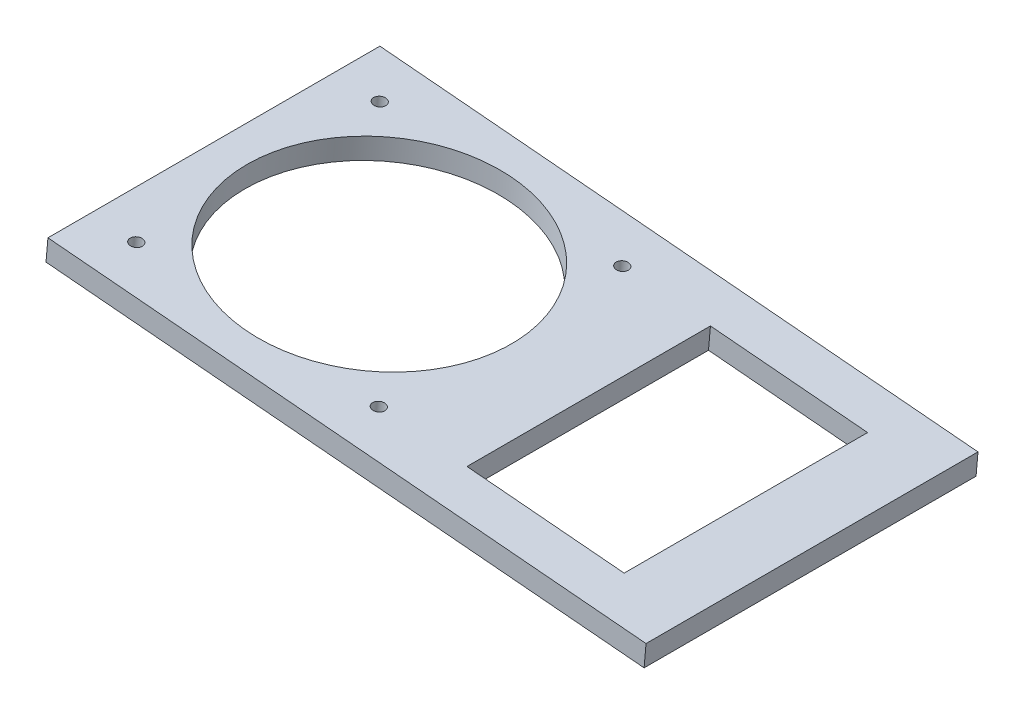
ISO-10303-21;
HEADER;
FILE_DESCRIPTION(('STEP AP214'),'2;1');
FILE_NAME('part.step','',(''),(''),'','','');
FILE_SCHEMA(('AUTOMOTIVE_DESIGN { 1 0 10303 214 1 1 1 1 }'));
ENDSEC;
DATA;
#1=APPLICATION_CONTEXT('core data for automotive mechanical design processes');
#2=APPLICATION_PROTOCOL_DEFINITION('international standard','automotive_design',2000,#1);
#3=PRODUCT_CONTEXT('',#1,'mechanical');
#4=PRODUCT('Part','Part','',(#3));
#5=PRODUCT_RELATED_PRODUCT_CATEGORY('part','',(#4));
#6=PRODUCT_DEFINITION_FORMATION('','',#4);
#7=PRODUCT_DEFINITION_CONTEXT('part definition',#1,'design');
#8=PRODUCT_DEFINITION('design','',#6,#7);
#9=PRODUCT_DEFINITION_SHAPE('','',#8);
#10=(LENGTH_UNIT() NAMED_UNIT(*) SI_UNIT(.MILLI.,.METRE.));
#11=(NAMED_UNIT(*) PLANE_ANGLE_UNIT() SI_UNIT($,.RADIAN.));
#12=(NAMED_UNIT(*) SI_UNIT($,.STERADIAN.) SOLID_ANGLE_UNIT());
#13=UNCERTAINTY_MEASURE_WITH_UNIT(LENGTH_MEASURE(1.E-05),#10,'distance_accuracy_value','');
#14=(GEOMETRIC_REPRESENTATION_CONTEXT(3) GLOBAL_UNCERTAINTY_ASSIGNED_CONTEXT((#13)) GLOBAL_UNIT_ASSIGNED_CONTEXT((#10,
#11,#12)) REPRESENTATION_CONTEXT('',''));
#15=CARTESIAN_POINT('',(0.,0.,0.));
#16=DIRECTION('',(0.,0.,1.));
#17=DIRECTION('',(1.,0.,0.));
#18=AXIS2_PLACEMENT_3D('',#15,#16,#17);
#19=CARTESIAN_POINT('',(-137.563755828843,331.297262379926,95.25));
#20=DIRECTION('',(-0.0871557427476588,-0.996194698091746,0.));
#21=DIRECTION('',(0.996194698091746,-0.0871557427476588,0.));
#22=AXIS2_PLACEMENT_3D('',#19,#20,#21);
#23=PLANE('',#22);
#24=DIRECTION('',(0.996194698091746,-0.0871557427476582,0.));
#25=VECTOR('',#24,1.);
#26=CARTESIAN_POINT('',(-30.0245381698388,321.888799950316,82.55));
#27=LINE('',#26,#25);
#28=CARTESIAN_POINT('',(-30.0245381698408,321.888799950316,82.55));
#29=VERTEX_POINT('',#28);
#30=CARTESIAN_POINT('',(15.0679589958335,317.943717638245,82.55));
#31=VERTEX_POINT('',#30);
#32=EDGE_CURVE('E109',#29,#31,#27,.T.);
#33=ORIENTED_EDGE('',*,*,#32,.F.);
#34=DIRECTION('',(0.,0.,1.));
#35=VECTOR('',#34,1.);
#36=CARTESIAN_POINT('',(-30.0245381698388,321.888799950316,12.7));
#37=LINE('',#36,#35);
#38=CARTESIAN_POINT('',(-30.0245381698388,321.888799950316,12.7));
#39=VERTEX_POINT('',#38);
#40=EDGE_CURVE('E47',#39,#29,#37,.T.);
#41=ORIENTED_EDGE('',*,*,#40,.F.);
#42=DIRECTION('',(-0.996194698091746,0.0871557427476582,0.));
#43=VECTOR('',#42,1.);
#44=CARTESIAN_POINT('',(-30.0245381698388,321.888799950316,12.7));
#45=LINE('',#44,#43);
#46=CARTESIAN_POINT('',(15.0679589958335,317.943717638245,12.7));
#47=VERTEX_POINT('',#46);
#48=EDGE_CURVE('E115',#47,#39,#45,.T.);
#49=ORIENTED_EDGE('',*,*,#48,.F.);
#50=DIRECTION('',(0.,0.,-1.));
#51=VECTOR('',#50,1.);
#52=CARTESIAN_POINT('',(15.0679589958335,317.943717638245,12.7));
#53=LINE('',#52,#51);
#54=EDGE_CURVE('E100',#31,#47,#53,.T.);
#55=ORIENTED_EDGE('',*,*,#54,.F.);
#56=EDGE_LOOP('',(#33,#41,#49,#55));
#57=FACE_BOUND('',#56,.T.);
#58=CARTESIAN_POINT('',(-55.3278835013691,324.102555816107,12.7));
#59=DIRECTION('',(0.0871557427476617,0.996194698091745,0.));
#60=DIRECTION('',(-0.996194698091745,0.0871557427476617,0.));
#61=AXIS2_PLACEMENT_3D('',#58,#59,#60);
#62=CIRCLE('',#61,1.74999999999909);
#63=CARTESIAN_POINT('',(-57.0712242230288,324.255078365915,12.7));
#64=VERTEX_POINT('',#63);
#65=EDGE_CURVE('E122',#64,#64,#62,.T.);
#66=ORIENTED_EDGE('',*,*,#65,.F.);
#67=EDGE_LOOP('',(#66));
#68=FACE_BOUND('',#67,.T.);
#69=CARTESIAN_POINT('',(-55.3278835013691,324.102555816107,82.55));
#70=DIRECTION('',(0.0871557427476617,0.996194698091745,0.));
#71=DIRECTION('',(-0.996194698091745,0.0871557427476617,0.));
#72=AXIS2_PLACEMENT_3D('',#69,#70,#71);
#73=CIRCLE('',#72,1.74999999999909);
#74=CARTESIAN_POINT('',(-57.0712242230288,324.255078365915,82.55));
#75=VERTEX_POINT('',#74);
#76=EDGE_CURVE('E128',#75,#75,#73,.T.);
#77=ORIENTED_EDGE('',*,*,#76,.F.);
#78=EDGE_LOOP('',(#77));
#79=FACE_BOUND('',#78,.T.);
#80=CARTESIAN_POINT('',(-124.912083163078,330.190384447031,82.55));
#81=DIRECTION('',(0.0871557427476617,0.996194698091745,0.));
#82=DIRECTION('',(-0.996194698091745,0.0871557427476617,0.));
#83=AXIS2_PLACEMENT_3D('',#80,#81,#82);
#84=CIRCLE('',#83,1.74999999999911);
#85=CARTESIAN_POINT('',(-126.655423884737,330.342906996839,82.55));
#86=VERTEX_POINT('',#85);
#87=EDGE_CURVE('E132',#86,#86,#84,.T.);
#88=ORIENTED_EDGE('',*,*,#87,.F.);
#89=EDGE_LOOP('',(#88));
#90=FACE_BOUND('',#89,.T.);
#91=CARTESIAN_POINT('',(-124.912083163078,330.190384447031,12.7));
#92=DIRECTION('',(0.0871557427476617,0.996194698091745,0.));
#93=DIRECTION('',(-0.996194698091745,0.0871557427476617,0.));
#94=AXIS2_PLACEMENT_3D('',#91,#92,#93);
#95=CIRCLE('',#94,1.74999999999911);
#96=CARTESIAN_POINT('',(-126.655423884737,330.342906996839,12.7));
#97=VERTEX_POINT('',#96);
#98=EDGE_CURVE('E136',#97,#97,#95,.T.);
#99=ORIENTED_EDGE('',*,*,#98,.F.);
#100=EDGE_LOOP('',(#99));
#101=FACE_BOUND('',#100,.T.);
#102=CARTESIAN_POINT('',(-90.1199833322233,327.146470131569,47.625));
#103=DIRECTION('',(0.0871557427476617,0.996194698091745,0.));
#104=DIRECTION('',(-0.996194698091745,0.0871557427476617,0.));
#105=AXIS2_PLACEMENT_3D('',#102,#103,#104);
#106=CIRCLE('',#105,38.0999999999991);
#107=CARTESIAN_POINT('',(-128.075001329518,330.467103930255,47.625));
#108=VERTEX_POINT('',#107);
#109=EDGE_CURVE('E140',#108,#108,#106,.T.);
#110=ORIENTED_EDGE('',*,*,#109,.F.);
#111=EDGE_LOOP('',(#110));
#112=FACE_BOUND('',#111,.T.);
#113=DIRECTION('',(-0.996194698091745,0.0871557427476588,0.));
#114=VECTOR('',#113,1.);
#115=CARTESIAN_POINT('',(-137.563755828843,331.297262379926,0.));
#116=LINE('',#115,#114);
#117=CARTESIAN_POINT('',(34.0454679944822,316.283400738902,0.));
#118=VERTEX_POINT('',#117);
#119=CARTESIAN_POINT('',(-137.563755828843,331.297262379926,0.));
#120=VERTEX_POINT('',#119);
#121=EDGE_CURVE('E155',#118,#120,#116,.T.);
#122=ORIENTED_EDGE('',*,*,#121,.T.);
#123=DIRECTION('',(0.,0.,-1.));
#124=VECTOR('',#123,1.);
#125=CARTESIAN_POINT('',(-137.563755828843,331.297262379926,95.25));
#126=LINE('',#125,#124);
#127=CARTESIAN_POINT('',(-137.563755828843,331.297262379926,95.25));
#128=VERTEX_POINT('',#127);
#129=EDGE_CURVE('E171',#128,#120,#126,.T.);
#130=ORIENTED_EDGE('',*,*,#129,.F.);
#131=DIRECTION('',(-0.996194698091745,0.0871557427476588,0.));
#132=VECTOR('',#131,1.);
#133=CARTESIAN_POINT('',(-137.563755828843,331.297262379926,95.25));
#134=LINE('',#133,#132);
#135=CARTESIAN_POINT('',(34.0454679944822,316.283400738902,95.25));
#136=VERTEX_POINT('',#135);
#137=EDGE_CURVE('E144',#136,#128,#134,.T.);
#138=ORIENTED_EDGE('',*,*,#137,.F.);
#139=DIRECTION('',(0.,0.,-1.));
#140=VECTOR('',#139,1.);
#141=CARTESIAN_POINT('',(34.0454679944822,316.283400738902,95.25));
#142=LINE('',#141,#140);
#143=EDGE_CURVE('E154',#136,#118,#142,.T.);
#144=ORIENTED_EDGE('',*,*,#143,.T.);
#145=EDGE_LOOP('',(#122,#130,#138,#144));
#146=FACE_BOUND('',#145,.T.);
#147=ADVANCED_FACE('F33',(#57,#68,#79,#90,#101,#112,#146),#23,.F.);
#148=CARTESIAN_POINT('',(-137.563755828843,331.297262379926,95.25));
#149=DIRECTION('',(0.996194698091746,-0.0871557427476588,0.));
#150=DIRECTION('',(0.0871557427476588,0.996194698091746,0.));
#151=AXIS2_PLACEMENT_3D('',#148,#149,#150);
#152=PLANE('',#151);
#153=DIRECTION('',(-0.0871557427476588,-0.996194698091745,0.));
#154=VECTOR('',#153,1.);
#155=CARTESIAN_POINT('',(-137.563755828843,331.297262379926,0.));
#156=LINE('',#155,#154);
#157=CARTESIAN_POINT('',(-138.11719479529,324.971426047043,0.));
#158=VERTEX_POINT('',#157);
#159=EDGE_CURVE('E158',#120,#158,#156,.T.);
#160=ORIENTED_EDGE('',*,*,#159,.T.);
#161=DIRECTION('',(0.,0.,-1.));
#162=VECTOR('',#161,1.);
#163=CARTESIAN_POINT('',(-138.11719479529,324.971426047043,95.25));
#164=LINE('',#163,#162);
#165=CARTESIAN_POINT('',(-138.11719479529,324.971426047043,95.25));
#166=VERTEX_POINT('',#165);
#167=EDGE_CURVE('E168',#166,#158,#164,.T.);
#168=ORIENTED_EDGE('',*,*,#167,.F.);
#169=DIRECTION('',(-0.0871557427476588,-0.996194698091745,0.));
#170=VECTOR('',#169,1.);
#171=CARTESIAN_POINT('',(-137.563755828843,331.297262379926,95.25));
#172=LINE('',#171,#170);
#173=EDGE_CURVE('E147',#128,#166,#172,.T.);
#174=ORIENTED_EDGE('',*,*,#173,.F.);
#175=ORIENTED_EDGE('',*,*,#129,.T.);
#176=EDGE_LOOP('',(#160,#168,#174,#175));
#177=FACE_BOUND('',#176,.T.);
#178=ADVANCED_FACE('F207',(#177),#152,.F.);
#179=CARTESIAN_POINT('',(-138.11719479529,324.971426047043,95.25));
#180=DIRECTION('',(0.0871557427476585,0.996194698091746,0.));
#181=DIRECTION('',(-0.996194698091746,0.0871557427476585,0.));
#182=AXIS2_PLACEMENT_3D('',#179,#180,#181);
#183=PLANE('',#182);
#184=DIRECTION('',(-0.996194698091746,0.0871557427476585,0.));
#185=VECTOR('',#184,1.);
#186=CARTESIAN_POINT('',(-138.11719479529,324.971426047043,12.7));
#187=LINE('',#186,#185);
#188=CARTESIAN_POINT('',(14.5145200293859,311.617881305362,12.7));
#189=VERTEX_POINT('',#188);
#190=CARTESIAN_POINT('',(-30.5779771362865,315.562963617433,12.7));
#191=VERTEX_POINT('',#190);
#192=EDGE_CURVE('E40',#189,#191,#187,.T.);
#193=ORIENTED_EDGE('',*,*,#192,.T.);
#194=DIRECTION('',(0.,0.,1.));
#195=VECTOR('',#194,1.);
#196=CARTESIAN_POINT('',(-30.5779771362865,315.562963617433,95.25));
#197=LINE('',#196,#195);
#198=CARTESIAN_POINT('',(-30.5779771362865,315.562963617433,82.55));
#199=VERTEX_POINT('',#198);
#200=EDGE_CURVE('E11',#191,#199,#197,.T.);
#201=ORIENTED_EDGE('',*,*,#200,.T.);
#202=DIRECTION('',(0.996194698091746,-0.0871557427476585,0.));
#203=VECTOR('',#202,1.);
#204=CARTESIAN_POINT('',(-138.11719479529,324.971426047043,82.55));
#205=LINE('',#204,#203);
#206=CARTESIAN_POINT('',(14.5145200293859,311.617881305362,82.55));
#207=VERTEX_POINT('',#206);
#208=EDGE_CURVE('E174',#199,#207,#205,.T.);
#209=ORIENTED_EDGE('',*,*,#208,.T.);
#210=DIRECTION('',(0.,0.,-1.));
#211=VECTOR('',#210,1.);
#212=CARTESIAN_POINT('',(14.5145200293859,311.617881305362,95.25));
#213=LINE('',#212,#211);
#214=EDGE_CURVE('E103',#207,#189,#213,.T.);
#215=ORIENTED_EDGE('',*,*,#214,.T.);
#216=EDGE_LOOP('',(#193,#201,#209,#215));
#217=FACE_BOUND('',#216,.T.);
#218=CARTESIAN_POINT('',(-55.8813224678168,317.776719483224,12.7));
#219=DIRECTION('',(0.0871557427476585,0.996194698091746,0.));
#220=DIRECTION('',(-0.996194698091746,0.0871557427476585,0.));
#221=AXIS2_PLACEMENT_3D('',#218,#219,#220);
#222=CIRCLE('',#221,1.74999999999909);
#223=CARTESIAN_POINT('',(-57.6246631894765,317.929242033032,12.7));
#224=VERTEX_POINT('',#223);
#225=EDGE_CURVE('E127',#224,#224,#222,.T.);
#226=ORIENTED_EDGE('',*,*,#225,.T.);
#227=EDGE_LOOP('',(#226));
#228=FACE_BOUND('',#227,.T.);
#229=CARTESIAN_POINT('',(-55.8813224678168,317.776719483224,82.55));
#230=DIRECTION('',(0.0871557427476585,0.996194698091746,0.));
#231=DIRECTION('',(-0.996194698091746,0.0871557427476585,0.));
#232=AXIS2_PLACEMENT_3D('',#229,#230,#231);
#233=CIRCLE('',#232,1.74999999999909);
#234=CARTESIAN_POINT('',(-57.6246631894765,317.929242033032,82.55));
#235=VERTEX_POINT('',#234);
#236=EDGE_CURVE('E131',#235,#235,#233,.T.);
#237=ORIENTED_EDGE('',*,*,#236,.T.);
#238=EDGE_LOOP('',(#237));
#239=FACE_BOUND('',#238,.T.);
#240=CARTESIAN_POINT('',(-125.465522129525,323.864548114148,82.55));
#241=DIRECTION('',(0.0871557427476585,0.996194698091746,0.));
#242=DIRECTION('',(-0.996194698091746,0.0871557427476585,0.));
#243=AXIS2_PLACEMENT_3D('',#240,#241,#242);
#244=CIRCLE('',#243,1.74999999999911);
#245=CARTESIAN_POINT('',(-127.208862851185,324.017070663956,82.55));
#246=VERTEX_POINT('',#245);
#247=EDGE_CURVE('E135',#246,#246,#244,.T.);
#248=ORIENTED_EDGE('',*,*,#247,.T.);
#249=EDGE_LOOP('',(#248));
#250=FACE_BOUND('',#249,.T.);
#251=CARTESIAN_POINT('',(-125.465522129525,323.864548114148,12.7));
#252=DIRECTION('',(0.0871557427476585,0.996194698091746,0.));
#253=DIRECTION('',(-0.996194698091746,0.0871557427476585,0.));
#254=AXIS2_PLACEMENT_3D('',#251,#252,#253);
#255=CIRCLE('',#254,1.74999999999911);
#256=CARTESIAN_POINT('',(-127.208862851185,324.017070663956,12.7));
#257=VERTEX_POINT('',#256);
#258=EDGE_CURVE('E139',#257,#257,#255,.T.);
#259=ORIENTED_EDGE('',*,*,#258,.T.);
#260=EDGE_LOOP('',(#259));
#261=FACE_BOUND('',#260,.T.);
#262=CARTESIAN_POINT('',(-90.673422298671,320.820633798686,47.625));
#263=DIRECTION('',(0.0871557427476585,0.996194698091746,0.));
#264=DIRECTION('',(-0.996194698091746,0.0871557427476585,0.));
#265=AXIS2_PLACEMENT_3D('',#262,#263,#264);
#266=CIRCLE('',#265,38.0999999999991);
#267=CARTESIAN_POINT('',(-128.628440295966,324.141267597372,47.625));
#268=VERTEX_POINT('',#267);
#269=EDGE_CURVE('E143',#268,#268,#266,.T.);
#270=ORIENTED_EDGE('',*,*,#269,.T.);
#271=EDGE_LOOP('',(#270));
#272=FACE_BOUND('',#271,.T.);
#273=DIRECTION('',(0.996194698091745,-0.0871557427476585,0.));
#274=VECTOR('',#273,1.);
#275=CARTESIAN_POINT('',(-138.11719479529,324.971426047043,0.));
#276=LINE('',#275,#274);
#277=CARTESIAN_POINT('',(33.4920290280346,309.957564406019,0.));
#278=VERTEX_POINT('',#277);
#279=EDGE_CURVE('E160',#158,#278,#276,.T.);
#280=ORIENTED_EDGE('',*,*,#279,.T.);
#281=DIRECTION('',(0.,0.,-1.));
#282=VECTOR('',#281,1.);
#283=CARTESIAN_POINT('',(33.4920290280346,309.957564406019,95.25));
#284=LINE('',#283,#282);
#285=CARTESIAN_POINT('',(33.4920290280346,309.957564406019,95.25));
#286=VERTEX_POINT('',#285);
#287=EDGE_CURVE('E165',#286,#278,#284,.T.);
#288=ORIENTED_EDGE('',*,*,#287,.F.);
#289=DIRECTION('',(0.996194698091745,-0.0871557427476585,0.));
#290=VECTOR('',#289,1.);
#291=CARTESIAN_POINT('',(-138.11719479529,324.971426047043,95.25));
#292=LINE('',#291,#290);
#293=EDGE_CURVE('E150',#166,#286,#292,.T.);
#294=ORIENTED_EDGE('',*,*,#293,.F.);
#295=ORIENTED_EDGE('',*,*,#167,.T.);
#296=EDGE_LOOP('',(#280,#288,#294,#295));
#297=FACE_BOUND('',#296,.T.);
#298=ADVANCED_FACE('F188',(#217,#228,#239,#250,#261,#272,#297),#183,.F.);
#299=CARTESIAN_POINT('',(34.0454679944822,316.283400738902,95.25));
#300=DIRECTION('',(-0.996194698091745,0.0871557427476606,0.));
#301=DIRECTION('',(-0.0871557427476606,-0.996194698091745,0.));
#302=AXIS2_PLACEMENT_3D('',#299,#300,#301);
#303=PLANE('',#302);
#304=DIRECTION('',(0.0871557427476607,0.996194698091745,0.));
#305=VECTOR('',#304,1.);
#306=CARTESIAN_POINT('',(34.0454679944822,316.283400738902,0.));
#307=LINE('',#306,#305);
#308=EDGE_CURVE('E148',#278,#118,#307,.T.);
#309=ORIENTED_EDGE('',*,*,#308,.T.);
#310=ORIENTED_EDGE('',*,*,#143,.F.);
#311=DIRECTION('',(0.0871557427476607,0.996194698091745,0.));
#312=VECTOR('',#311,1.);
#313=CARTESIAN_POINT('',(34.0454679944822,316.283400738902,95.25));
#314=LINE('',#313,#312);
#315=EDGE_CURVE('E152',#286,#136,#314,.T.);
#316=ORIENTED_EDGE('',*,*,#315,.F.);
#317=ORIENTED_EDGE('',*,*,#287,.T.);
#318=EDGE_LOOP('',(#309,#310,#316,#317));
#319=FACE_BOUND('',#318,.T.);
#320=ADVANCED_FACE('F215',(#319),#303,.F.);
#321=CARTESIAN_POINT('',(0.,0.,95.25));
#322=DIRECTION('',(0.,0.,-1.));
#323=DIRECTION('',(-1.,0.,0.));
#324=AXIS2_PLACEMENT_3D('',#321,#322,#323);
#325=PLANE('',#324);
#326=ORIENTED_EDGE('',*,*,#137,.T.);
#327=ORIENTED_EDGE('',*,*,#173,.T.);
#328=ORIENTED_EDGE('',*,*,#293,.T.);
#329=ORIENTED_EDGE('',*,*,#315,.T.);
#330=EDGE_LOOP('',(#326,#327,#328,#329));
#331=FACE_BOUND('',#330,.T.);
#332=ADVANCED_FACE('F220',(#331),#325,.F.);
#333=CARTESIAN_POINT('',(0.,0.,0.));
#334=DIRECTION('',(0.,0.,-1.));
#335=DIRECTION('',(-1.,0.,0.));
#336=AXIS2_PLACEMENT_3D('',#333,#334,#335);
#337=PLANE('',#336);
#338=ORIENTED_EDGE('',*,*,#121,.F.);
#339=ORIENTED_EDGE('',*,*,#308,.F.);
#340=ORIENTED_EDGE('',*,*,#279,.F.);
#341=ORIENTED_EDGE('',*,*,#159,.F.);
#342=EDGE_LOOP('',(#338,#339,#340,#341));
#343=FACE_BOUND('',#342,.T.);
#344=ADVANCED_FACE('F222',(#343),#337,.T.);
#345=CARTESIAN_POINT('',(-91.9769871555247,305.920819304807,47.625));
#346=DIRECTION('',(0.0871557427476617,0.996194698091745,0.));
#347=DIRECTION('',(-0.996194698091745,0.0871557427476617,0.));
#348=AXIS2_PLACEMENT_3D('',#345,#346,#347);
#349=CYLINDRICAL_SURFACE('',#348,38.0999999999991);
#350=ORIENTED_EDGE('',*,*,#109,.T.);
#351=EDGE_LOOP('',(#350));
#352=FACE_BOUND('',#351,.T.);
#353=ORIENTED_EDGE('',*,*,#269,.F.);
#354=EDGE_LOOP('',(#353));
#355=FACE_BOUND('',#354,.T.);
#356=ADVANCED_FACE('F225',(#352,#355),#349,.F.);
#357=CARTESIAN_POINT('',(-126.769086986379,308.964733620269,12.7));
#358=DIRECTION('',(0.0871557427476617,0.996194698091745,0.));
#359=DIRECTION('',(-0.996194698091745,0.0871557427476617,0.));
#360=AXIS2_PLACEMENT_3D('',#357,#358,#359);
#361=CYLINDRICAL_SURFACE('',#360,1.74999999999911);
#362=ORIENTED_EDGE('',*,*,#98,.T.);
#363=EDGE_LOOP('',(#362));
#364=FACE_BOUND('',#363,.T.);
#365=ORIENTED_EDGE('',*,*,#258,.F.);
#366=EDGE_LOOP('',(#365));
#367=FACE_BOUND('',#366,.T.);
#368=ADVANCED_FACE('F232',(#364,#367),#361,.F.);
#369=CARTESIAN_POINT('',(-126.769086986379,308.964733620269,82.55));
#370=DIRECTION('',(0.0871557427476617,0.996194698091745,0.));
#371=DIRECTION('',(-0.996194698091745,0.0871557427476617,0.));
#372=AXIS2_PLACEMENT_3D('',#369,#370,#371);
#373=CYLINDRICAL_SURFACE('',#372,1.74999999999911);
#374=ORIENTED_EDGE('',*,*,#87,.T.);
#375=EDGE_LOOP('',(#374));
#376=FACE_BOUND('',#375,.T.);
#377=ORIENTED_EDGE('',*,*,#247,.F.);
#378=EDGE_LOOP('',(#377));
#379=FACE_BOUND('',#378,.T.);
#380=ADVANCED_FACE('F236',(#376,#379),#373,.F.);
#381=CARTESIAN_POINT('',(-57.1848873246705,302.876904989345,82.55));
#382=DIRECTION('',(0.0871557427476617,0.996194698091745,0.));
#383=DIRECTION('',(-0.996194698091745,0.0871557427476617,0.));
#384=AXIS2_PLACEMENT_3D('',#381,#382,#383);
#385=CYLINDRICAL_SURFACE('',#384,1.74999999999909);
#386=ORIENTED_EDGE('',*,*,#76,.T.);
#387=EDGE_LOOP('',(#386));
#388=FACE_BOUND('',#387,.T.);
#389=ORIENTED_EDGE('',*,*,#236,.F.);
#390=EDGE_LOOP('',(#389));
#391=FACE_BOUND('',#390,.T.);
#392=ADVANCED_FACE('F202',(#388,#391),#385,.F.);
#393=CARTESIAN_POINT('',(-57.1848873246705,302.876904989345,12.7));
#394=DIRECTION('',(0.0871557427476617,0.996194698091745,0.));
#395=DIRECTION('',(-0.996194698091745,0.0871557427476617,0.));
#396=AXIS2_PLACEMENT_3D('',#393,#394,#395);
#397=CYLINDRICAL_SURFACE('',#396,1.74999999999909);
#398=ORIENTED_EDGE('',*,*,#65,.T.);
#399=EDGE_LOOP('',(#398));
#400=FACE_BOUND('',#399,.T.);
#401=ORIENTED_EDGE('',*,*,#225,.F.);
#402=EDGE_LOOP('',(#401));
#403=FACE_BOUND('',#402,.T.);
#404=ADVANCED_FACE('F195',(#400,#403),#397,.F.);
#405=CARTESIAN_POINT('',(-31.8815419931401,300.663149123555,12.7));
#406=DIRECTION('',(-0.996194698091746,0.0871557427476588,0.));
#407=DIRECTION('',(-0.0871557427476588,-0.996194698091746,0.));
#408=AXIS2_PLACEMENT_3D('',#405,#406,#407);
#409=PLANE('',#408);
#410=DIRECTION('',(0.0871557427476588,0.996194698091746,0.));
#411=VECTOR('',#410,1.);
#412=CARTESIAN_POINT('',(-31.8815419931401,300.663149123555,12.7));
#413=LINE('',#412,#411);
#414=EDGE_CURVE('E120',#191,#39,#413,.T.);
#415=ORIENTED_EDGE('',*,*,#414,.T.);
#416=ORIENTED_EDGE('',*,*,#40,.T.);
#417=DIRECTION('',(0.0871557427476588,0.996194698091746,0.));
#418=VECTOR('',#417,1.);
#419=CARTESIAN_POINT('',(-31.8815419931401,300.663149123555,82.55));
#420=LINE('',#419,#418);
#421=EDGE_CURVE('E106',#199,#29,#420,.T.);
#422=ORIENTED_EDGE('',*,*,#421,.F.);
#423=ORIENTED_EDGE('',*,*,#200,.F.);
#424=EDGE_LOOP('',(#415,#416,#422,#423));
#425=FACE_BOUND('',#424,.T.);
#426=ADVANCED_FACE('F193',(#425),#409,.F.);
#427=CARTESIAN_POINT('',(-31.8815419931401,300.663149123555,12.7));
#428=DIRECTION('',(0.,0.,-1.));
#429=DIRECTION('',(-1.,0.,0.));
#430=AXIS2_PLACEMENT_3D('',#427,#428,#429);
#431=PLANE('',#430);
#432=DIRECTION('',(0.0871557427476588,0.996194698091746,0.));
#433=VECTOR('',#432,1.);
#434=CARTESIAN_POINT('',(13.2109551725322,296.718066811484,12.7));
#435=LINE('',#434,#433);
#436=EDGE_CURVE('E105',#189,#47,#435,.T.);
#437=ORIENTED_EDGE('',*,*,#436,.T.);
#438=ORIENTED_EDGE('',*,*,#48,.T.);
#439=ORIENTED_EDGE('',*,*,#414,.F.);
#440=ORIENTED_EDGE('',*,*,#192,.F.);
#441=EDGE_LOOP('',(#437,#438,#439,#440));
#442=FACE_BOUND('',#441,.T.);
#443=ADVANCED_FACE('F192',(#442),#431,.F.);
#444=CARTESIAN_POINT('',(13.2109551725322,296.718066811484,12.7));
#445=DIRECTION('',(0.996194698091746,-0.0871557427476588,0.));
#446=DIRECTION('',(0.0871557427476588,0.996194698091746,0.));
#447=AXIS2_PLACEMENT_3D('',#444,#445,#446);
#448=PLANE('',#447);
#449=DIRECTION('',(0.0871557427476588,0.996194698091746,0.));
#450=VECTOR('',#449,1.);
#451=CARTESIAN_POINT('',(13.2109551725322,296.718066811484,82.55));
#452=LINE('',#451,#450);
#453=EDGE_CURVE('E55',#207,#31,#452,.T.);
#454=ORIENTED_EDGE('',*,*,#453,.T.);
#455=ORIENTED_EDGE('',*,*,#54,.T.);
#456=ORIENTED_EDGE('',*,*,#436,.F.);
#457=ORIENTED_EDGE('',*,*,#214,.F.);
#458=EDGE_LOOP('',(#454,#455,#456,#457));
#459=FACE_BOUND('',#458,.T.);
#460=ADVANCED_FACE('F97',(#459),#448,.F.);
#461=CARTESIAN_POINT('',(-31.8815419931401,300.663149123555,82.55));
#462=DIRECTION('',(0.,0.,1.));
#463=DIRECTION('',(1.,0.,0.));
#464=AXIS2_PLACEMENT_3D('',#461,#462,#463);
#465=PLANE('',#464);
#466=ORIENTED_EDGE('',*,*,#421,.T.);
#467=ORIENTED_EDGE('',*,*,#32,.T.);
#468=ORIENTED_EDGE('',*,*,#453,.F.);
#469=ORIENTED_EDGE('',*,*,#208,.F.);
#470=EDGE_LOOP('',(#466,#467,#468,#469));
#471=FACE_BOUND('',#470,.T.);
#472=ADVANCED_FACE('F110',(#471),#465,.F.);
#473=CLOSED_SHELL('',(#147,#178,#298,#320,#332,#344,#356,#368,#380,#392,#404,#426,#443,#460,#472));
#474=MANIFOLD_SOLID_BREP('B2',#473);
#475=ADVANCED_BREP_SHAPE_REPRESENTATION('',(#18,#474),#14);
#476=SHAPE_DEFINITION_REPRESENTATION(#9,#475);
ENDSEC;
END-ISO-10303-21;
